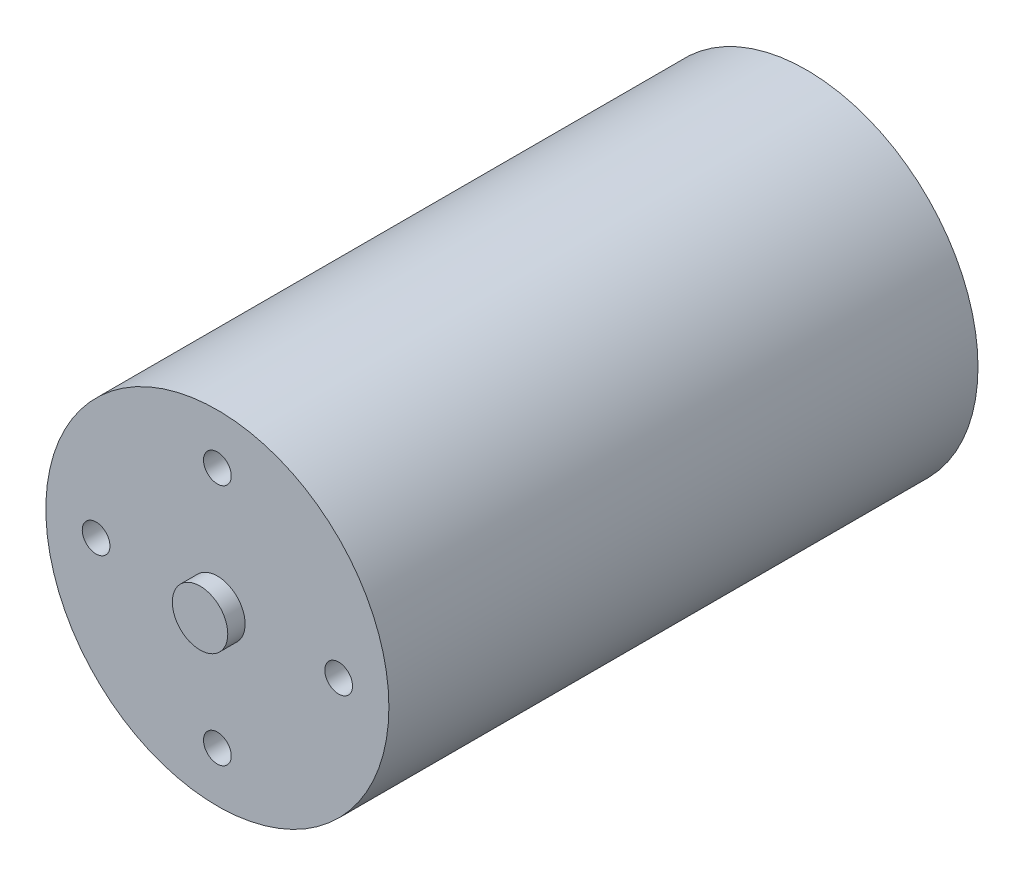
ISO-10303-21;
HEADER;
FILE_DESCRIPTION(('STEP AP214'),'2;1');
FILE_NAME('part.step','',(''),(''),'','','');
FILE_SCHEMA(('AUTOMOTIVE_DESIGN { 1 0 10303 214 1 1 1 1 }'));
ENDSEC;
DATA;
#1=APPLICATION_CONTEXT('core data for automotive mechanical design processes');
#2=APPLICATION_PROTOCOL_DEFINITION('international standard','automotive_design',2000,#1);
#3=PRODUCT_CONTEXT('',#1,'mechanical');
#4=PRODUCT('Part','Part','',(#3));
#5=PRODUCT_RELATED_PRODUCT_CATEGORY('part','',(#4));
#6=PRODUCT_DEFINITION_FORMATION('','',#4);
#7=PRODUCT_DEFINITION_CONTEXT('part definition',#1,'design');
#8=PRODUCT_DEFINITION('design','',#6,#7);
#9=PRODUCT_DEFINITION_SHAPE('','',#8);
#10=(LENGTH_UNIT() NAMED_UNIT(*) SI_UNIT(.MILLI.,.METRE.));
#11=(NAMED_UNIT(*) PLANE_ANGLE_UNIT() SI_UNIT($,.RADIAN.));
#12=(NAMED_UNIT(*) SI_UNIT($,.STERADIAN.) SOLID_ANGLE_UNIT());
#13=UNCERTAINTY_MEASURE_WITH_UNIT(LENGTH_MEASURE(1.E-05),#10,'distance_accuracy_value','');
#14=(GEOMETRIC_REPRESENTATION_CONTEXT(3) GLOBAL_UNCERTAINTY_ASSIGNED_CONTEXT((#13)) GLOBAL_UNIT_ASSIGNED_CONTEXT((#10,
#11,#12)) REPRESENTATION_CONTEXT('',''));
#15=CARTESIAN_POINT('',(0.,0.,0.));
#16=DIRECTION('',(0.,0.,1.));
#17=DIRECTION('',(1.,0.,0.));
#18=AXIS2_PLACEMENT_3D('',#15,#16,#17);
#19=CARTESIAN_POINT('',(0.,0.,-42.5));
#20=DIRECTION('',(0.,0.,1.));
#21=DIRECTION('',(1.,0.,0.));
#22=AXIS2_PLACEMENT_3D('',#19,#20,#21);
#23=CYLINDRICAL_SURFACE('',#22,24.75);
#24=CARTESIAN_POINT('',(0.,0.,-42.5));
#25=DIRECTION('',(0.,0.,1.));
#26=DIRECTION('',(1.,0.,0.));
#27=AXIS2_PLACEMENT_3D('',#24,#25,#26);
#28=CIRCLE('',#27,24.75);
#29=CARTESIAN_POINT('',(24.75,0.,-42.5));
#30=VERTEX_POINT('',#29);
#31=EDGE_CURVE('E49',#30,#30,#28,.T.);
#32=ORIENTED_EDGE('',*,*,#31,.T.);
#33=EDGE_LOOP('',(#32));
#34=FACE_BOUND('',#33,.T.);
#35=CARTESIAN_POINT('',(0.,0.,42.5));
#36=DIRECTION('',(0.,0.,1.));
#37=DIRECTION('',(1.,0.,0.));
#38=AXIS2_PLACEMENT_3D('',#35,#36,#37);
#39=CIRCLE('',#38,24.75);
#40=CARTESIAN_POINT('',(24.75,0.,42.5));
#41=VERTEX_POINT('',#40);
#42=EDGE_CURVE('E55',#41,#41,#39,.T.);
#43=ORIENTED_EDGE('',*,*,#42,.F.);
#44=EDGE_LOOP('',(#43));
#45=FACE_BOUND('',#44,.T.);
#46=ADVANCED_FACE('F37',(#34,#45),#23,.T.);
#47=CARTESIAN_POINT('',(0.,0.,-42.5));
#48=DIRECTION('',(0.,0.,1.));
#49=DIRECTION('',(1.,0.,0.));
#50=AXIS2_PLACEMENT_3D('',#47,#48,#49);
#51=PLANE('',#50);
#52=CARTESIAN_POINT('',(0.,0.,-42.5));
#53=DIRECTION('',(0.,0.,1.));
#54=DIRECTION('',(1.,0.,0.));
#55=AXIS2_PLACEMENT_3D('',#52,#53,#54);
#56=CIRCLE('',#55,10.5);
#57=CARTESIAN_POINT('',(10.5,0.,-42.5));
#58=VERTEX_POINT('',#57);
#59=EDGE_CURVE('E10',#58,#58,#56,.F.);
#60=ORIENTED_EDGE('',*,*,#59,.F.);
#61=EDGE_LOOP('',(#60));
#62=FACE_BOUND('',#61,.T.);
#63=CARTESIAN_POINT('',(0.,17.5,-42.5));
#64=DIRECTION('',(0.,0.,-1.));
#65=DIRECTION('',(0.,-1.,0.));
#66=AXIS2_PLACEMENT_3D('',#63,#64,#65);
#67=CIRCLE('',#66,2.);
#68=CARTESIAN_POINT('',(0.,15.5,-42.5));
#69=VERTEX_POINT('',#68);
#70=EDGE_CURVE('E128',#69,#69,#67,.T.);
#71=ORIENTED_EDGE('',*,*,#70,.F.);
#72=EDGE_LOOP('',(#71));
#73=FACE_BOUND('',#72,.T.);
#74=CARTESIAN_POINT('',(-17.5,0.,-42.5));
#75=DIRECTION('',(0.,0.,-1.));
#76=DIRECTION('',(1.,0.,0.));
#77=AXIS2_PLACEMENT_3D('',#74,#75,#76);
#78=CIRCLE('',#77,2.);
#79=CARTESIAN_POINT('',(-15.5,0.,-42.5));
#80=VERTEX_POINT('',#79);
#81=EDGE_CURVE('E120',#80,#80,#78,.T.);
#82=ORIENTED_EDGE('',*,*,#81,.F.);
#83=EDGE_LOOP('',(#82));
#84=FACE_BOUND('',#83,.T.);
#85=CARTESIAN_POINT('',(1.83302770289265E-13,-17.5,-42.5));
#86=DIRECTION('',(0.,0.,-1.));
#87=DIRECTION('',(0.,1.,0.));
#88=AXIS2_PLACEMENT_3D('',#85,#86,#87);
#89=CIRCLE('',#88,2.);
#90=CARTESIAN_POINT('',(1.62353882256206E-13,-15.5,-42.5));
#91=VERTEX_POINT('',#90);
#92=EDGE_CURVE('E111',#91,#91,#89,.T.);
#93=ORIENTED_EDGE('',*,*,#92,.F.);
#94=EDGE_LOOP('',(#93));
#95=FACE_BOUND('',#94,.T.);
#96=CARTESIAN_POINT('',(17.5,0.,-42.5));
#97=DIRECTION('',(0.,0.,-1.));
#98=DIRECTION('',(-1.,0.,0.));
#99=AXIS2_PLACEMENT_3D('',#96,#97,#98);
#100=CIRCLE('',#99,2.);
#101=CARTESIAN_POINT('',(15.5,0.,-42.5));
#102=VERTEX_POINT('',#101);
#103=EDGE_CURVE('E103',#102,#102,#100,.T.);
#104=ORIENTED_EDGE('',*,*,#103,.F.);
#105=EDGE_LOOP('',(#104));
#106=FACE_BOUND('',#105,.T.);
#107=ORIENTED_EDGE('',*,*,#31,.F.);
#108=EDGE_LOOP('',(#107));
#109=FACE_BOUND('',#108,.T.);
#110=ADVANCED_FACE('F154',(#62,#73,#84,#95,#106,#109),#51,.F.);
#111=CARTESIAN_POINT('',(0.,0.,42.5));
#112=DIRECTION('',(0.,0.,1.));
#113=DIRECTION('',(1.,0.,0.));
#114=AXIS2_PLACEMENT_3D('',#111,#112,#113);
#115=PLANE('',#114);
#116=CARTESIAN_POINT('',(-17.5,0.,42.5));
#117=DIRECTION('',(0.,0.,1.));
#118=DIRECTION('',(0.,1.,0.));
#119=AXIS2_PLACEMENT_3D('',#116,#117,#118);
#120=CIRCLE('',#119,2.);
#121=CARTESIAN_POINT('',(-17.5,1.99999999999994,42.5));
#122=VERTEX_POINT('',#121);
#123=EDGE_CURVE('E96',#122,#122,#120,.T.);
#124=ORIENTED_EDGE('',*,*,#123,.F.);
#125=EDGE_LOOP('',(#124));
#126=FACE_BOUND('',#125,.T.);
#127=CARTESIAN_POINT('',(0.,-17.5,42.5));
#128=DIRECTION('',(0.,0.,1.));
#129=DIRECTION('',(-1.,0.,0.));
#130=AXIS2_PLACEMENT_3D('',#127,#128,#129);
#131=CIRCLE('',#130,2.);
#132=CARTESIAN_POINT('',(-2.,-17.5,42.5));
#133=VERTEX_POINT('',#132);
#134=EDGE_CURVE('E88',#133,#133,#131,.T.);
#135=ORIENTED_EDGE('',*,*,#134,.F.);
#136=EDGE_LOOP('',(#135));
#137=FACE_BOUND('',#136,.T.);
#138=CARTESIAN_POINT('',(17.5,1.83302770289265E-13,42.5));
#139=DIRECTION('',(0.,0.,1.));
#140=DIRECTION('',(0.,-1.,0.));
#141=AXIS2_PLACEMENT_3D('',#138,#139,#140);
#142=CIRCLE('',#141,2.);
#143=CARTESIAN_POINT('',(17.5,-1.99999999999982,42.5));
#144=VERTEX_POINT('',#143);
#145=EDGE_CURVE('E79',#144,#144,#142,.T.);
#146=ORIENTED_EDGE('',*,*,#145,.F.);
#147=EDGE_LOOP('',(#146));
#148=FACE_BOUND('',#147,.T.);
#149=CARTESIAN_POINT('',(0.,17.5,42.5));
#150=DIRECTION('',(0.,0.,1.));
#151=DIRECTION('',(1.,0.,0.));
#152=AXIS2_PLACEMENT_3D('',#149,#150,#151);
#153=CIRCLE('',#152,2.);
#154=CARTESIAN_POINT('',(2.,17.5,42.5));
#155=VERTEX_POINT('',#154);
#156=EDGE_CURVE('E71',#155,#155,#153,.T.);
#157=ORIENTED_EDGE('',*,*,#156,.F.);
#158=EDGE_LOOP('',(#157));
#159=FACE_BOUND('',#158,.T.);
#160=CARTESIAN_POINT('',(0.,0.,42.5));
#161=DIRECTION('',(0.,0.,1.));
#162=DIRECTION('',(1.,0.,0.));
#163=AXIS2_PLACEMENT_3D('',#160,#161,#162);
#164=CIRCLE('',#163,4.);
#165=CARTESIAN_POINT('',(4.,0.,42.5));
#166=VERTEX_POINT('',#165);
#167=EDGE_CURVE('E44',#166,#166,#164,.T.);
#168=ORIENTED_EDGE('',*,*,#167,.F.);
#169=EDGE_LOOP('',(#168));
#170=FACE_BOUND('',#169,.T.);
#171=ORIENTED_EDGE('',*,*,#42,.T.);
#172=EDGE_LOOP('',(#171));
#173=FACE_BOUND('',#172,.T.);
#174=ADVANCED_FACE('F159',(#126,#137,#148,#159,#170,#173),#115,.T.);
#175=CARTESIAN_POINT('',(0.,0.,45.));
#176=DIRECTION('',(0.,0.,-1.));
#177=DIRECTION('',(-1.,0.,0.));
#178=AXIS2_PLACEMENT_3D('',#175,#176,#177);
#179=CYLINDRICAL_SURFACE('',#178,4.);
#180=CARTESIAN_POINT('',(0.,0.,45.));
#181=DIRECTION('',(0.,0.,1.));
#182=DIRECTION('',(1.,0.,0.));
#183=AXIS2_PLACEMENT_3D('',#180,#181,#182);
#184=CIRCLE('',#183,4.);
#185=CARTESIAN_POINT('',(4.,0.,45.));
#186=VERTEX_POINT('',#185);
#187=EDGE_CURVE('E58',#186,#186,#184,.T.);
#188=ORIENTED_EDGE('',*,*,#187,.F.);
#189=EDGE_LOOP('',(#188));
#190=FACE_BOUND('',#189,.T.);
#191=ORIENTED_EDGE('',*,*,#167,.T.);
#192=EDGE_LOOP('',(#191));
#193=FACE_BOUND('',#192,.T.);
#194=ADVANCED_FACE('F168',(#190,#193),#179,.T.);
#195=CARTESIAN_POINT('',(0.,0.,45.));
#196=DIRECTION('',(0.,0.,1.));
#197=DIRECTION('',(1.,0.,0.));
#198=AXIS2_PLACEMENT_3D('',#195,#196,#197);
#199=PLANE('',#198);
#200=ORIENTED_EDGE('',*,*,#187,.T.);
#201=EDGE_LOOP('',(#200));
#202=FACE_BOUND('',#201,.T.);
#203=ADVANCED_FACE('F174',(#202),#199,.T.);
#204=CARTESIAN_POINT('',(0.,17.5,37.5));
#205=DIRECTION('',(0.,0.,1.));
#206=DIRECTION('',(1.,0.,0.));
#207=AXIS2_PLACEMENT_3D('',#204,#205,#206);
#208=CYLINDRICAL_SURFACE('',#207,2.);
#209=CARTESIAN_POINT('',(0.,17.5,37.5));
#210=DIRECTION('',(0.,0.,1.));
#211=DIRECTION('',(1.,0.,0.));
#212=AXIS2_PLACEMENT_3D('',#209,#210,#211);
#213=CIRCLE('',#212,2.);
#214=CARTESIAN_POINT('',(2.,17.5,37.5));
#215=VERTEX_POINT('',#214);
#216=EDGE_CURVE('E66',#215,#215,#213,.T.);
#217=ORIENTED_EDGE('',*,*,#216,.F.);
#218=EDGE_LOOP('',(#217));
#219=FACE_BOUND('',#218,.T.);
#220=ORIENTED_EDGE('',*,*,#156,.T.);
#221=EDGE_LOOP('',(#220));
#222=FACE_BOUND('',#221,.T.);
#223=ADVANCED_FACE('F178',(#219,#222),#208,.F.);
#224=CARTESIAN_POINT('',(0.,17.5,37.5));
#225=DIRECTION('',(0.,0.,1.));
#226=DIRECTION('',(1.,0.,0.));
#227=AXIS2_PLACEMENT_3D('',#224,#225,#226);
#228=PLANE('',#227);
#229=ORIENTED_EDGE('',*,*,#216,.T.);
#230=EDGE_LOOP('',(#229));
#231=FACE_BOUND('',#230,.T.);
#232=ADVANCED_FACE('F181',(#231),#228,.T.);
#233=CARTESIAN_POINT('',(17.5,1.83302770289265E-13,37.5));
#234=DIRECTION('',(0.,0.,1.));
#235=DIRECTION('',(1.,0.,0.));
#236=AXIS2_PLACEMENT_3D('',#233,#234,#235);
#237=CYLINDRICAL_SURFACE('',#236,2.);
#238=CARTESIAN_POINT('',(17.5,1.83302770289265E-13,37.5));
#239=DIRECTION('',(0.,0.,1.));
#240=DIRECTION('',(0.,-1.,0.));
#241=AXIS2_PLACEMENT_3D('',#238,#239,#240);
#242=CIRCLE('',#241,2.);
#243=CARTESIAN_POINT('',(17.5,-1.99999999999982,37.5));
#244=VERTEX_POINT('',#243);
#245=EDGE_CURVE('E83',#244,#244,#242,.T.);
#246=ORIENTED_EDGE('',*,*,#245,.F.);
#247=EDGE_LOOP('',(#246));
#248=FACE_BOUND('',#247,.T.);
#249=ORIENTED_EDGE('',*,*,#145,.T.);
#250=EDGE_LOOP('',(#249));
#251=FACE_BOUND('',#250,.T.);
#252=ADVANCED_FACE('F185',(#248,#251),#237,.F.);
#253=CARTESIAN_POINT('',(17.5,1.83302770289265E-13,37.5));
#254=DIRECTION('',(0.,0.,1.));
#255=DIRECTION('',(0.,-1.,0.));
#256=AXIS2_PLACEMENT_3D('',#253,#254,#255);
#257=PLANE('',#256);
#258=ORIENTED_EDGE('',*,*,#245,.T.);
#259=EDGE_LOOP('',(#258));
#260=FACE_BOUND('',#259,.T.);
#261=ADVANCED_FACE('F188',(#260),#257,.T.);
#262=CARTESIAN_POINT('',(0.,-17.5,37.5));
#263=DIRECTION('',(0.,0.,1.));
#264=DIRECTION('',(1.,0.,0.));
#265=AXIS2_PLACEMENT_3D('',#262,#263,#264);
#266=CYLINDRICAL_SURFACE('',#265,2.);
#267=CARTESIAN_POINT('',(0.,-17.5,37.5));
#268=DIRECTION('',(0.,0.,1.));
#269=DIRECTION('',(-1.,0.,0.));
#270=AXIS2_PLACEMENT_3D('',#267,#268,#269);
#271=CIRCLE('',#270,2.);
#272=CARTESIAN_POINT('',(-2.,-17.5,37.5));
#273=VERTEX_POINT('',#272);
#274=EDGE_CURVE('E92',#273,#273,#271,.T.);
#275=ORIENTED_EDGE('',*,*,#274,.F.);
#276=EDGE_LOOP('',(#275));
#277=FACE_BOUND('',#276,.T.);
#278=ORIENTED_EDGE('',*,*,#134,.T.);
#279=EDGE_LOOP('',(#278));
#280=FACE_BOUND('',#279,.T.);
#281=ADVANCED_FACE('F192',(#277,#280),#266,.F.);
#282=CARTESIAN_POINT('',(0.,-17.5,37.5));
#283=DIRECTION('',(0.,0.,1.));
#284=DIRECTION('',(-1.,0.,0.));
#285=AXIS2_PLACEMENT_3D('',#282,#283,#284);
#286=PLANE('',#285);
#287=ORIENTED_EDGE('',*,*,#274,.T.);
#288=EDGE_LOOP('',(#287));
#289=FACE_BOUND('',#288,.T.);
#290=ADVANCED_FACE('F196',(#289),#286,.T.);
#291=CARTESIAN_POINT('',(-17.5,0.,37.5));
#292=DIRECTION('',(0.,0.,1.));
#293=DIRECTION('',(1.,0.,0.));
#294=AXIS2_PLACEMENT_3D('',#291,#292,#293);
#295=CYLINDRICAL_SURFACE('',#294,2.);
#296=CARTESIAN_POINT('',(-17.5,0.,37.5));
#297=DIRECTION('',(0.,0.,1.));
#298=DIRECTION('',(0.,1.,0.));
#299=AXIS2_PLACEMENT_3D('',#296,#297,#298);
#300=CIRCLE('',#299,2.);
#301=CARTESIAN_POINT('',(-17.5,1.99999999999994,37.5));
#302=VERTEX_POINT('',#301);
#303=EDGE_CURVE('E77',#302,#302,#300,.T.);
#304=ORIENTED_EDGE('',*,*,#303,.F.);
#305=EDGE_LOOP('',(#304));
#306=FACE_BOUND('',#305,.T.);
#307=ORIENTED_EDGE('',*,*,#123,.T.);
#308=EDGE_LOOP('',(#307));
#309=FACE_BOUND('',#308,.T.);
#310=ADVANCED_FACE('F200',(#306,#309),#295,.F.);
#311=CARTESIAN_POINT('',(-17.5,0.,37.5));
#312=DIRECTION('',(0.,0.,1.));
#313=DIRECTION('',(0.,1.,0.));
#314=AXIS2_PLACEMENT_3D('',#311,#312,#313);
#315=PLANE('',#314);
#316=ORIENTED_EDGE('',*,*,#303,.T.);
#317=EDGE_LOOP('',(#316));
#318=FACE_BOUND('',#317,.T.);
#319=ADVANCED_FACE('F204',(#318),#315,.T.);
#320=CARTESIAN_POINT('',(17.5,0.,-32.5));
#321=DIRECTION('',(0.,0.,-1.));
#322=DIRECTION('',(-1.,0.,0.));
#323=AXIS2_PLACEMENT_3D('',#320,#321,#322);
#324=CYLINDRICAL_SURFACE('',#323,2.);
#325=CARTESIAN_POINT('',(17.5,0.,-32.5));
#326=DIRECTION('',(0.,0.,-1.));
#327=DIRECTION('',(-1.,0.,0.));
#328=AXIS2_PLACEMENT_3D('',#325,#326,#327);
#329=CIRCLE('',#328,2.);
#330=CARTESIAN_POINT('',(15.5,0.,-32.5));
#331=VERTEX_POINT('',#330);
#332=EDGE_CURVE('E84',#331,#331,#329,.T.);
#333=ORIENTED_EDGE('',*,*,#332,.F.);
#334=EDGE_LOOP('',(#333));
#335=FACE_BOUND('',#334,.T.);
#336=ORIENTED_EDGE('',*,*,#103,.T.);
#337=EDGE_LOOP('',(#336));
#338=FACE_BOUND('',#337,.T.);
#339=ADVANCED_FACE('F208',(#335,#338),#324,.F.);
#340=CARTESIAN_POINT('',(17.5,0.,-32.5));
#341=DIRECTION('',(0.,0.,-1.));
#342=DIRECTION('',(-1.,0.,0.));
#343=AXIS2_PLACEMENT_3D('',#340,#341,#342);
#344=PLANE('',#343);
#345=ORIENTED_EDGE('',*,*,#332,.T.);
#346=EDGE_LOOP('',(#345));
#347=FACE_BOUND('',#346,.T.);
#348=ADVANCED_FACE('F212',(#347),#344,.T.);
#349=CARTESIAN_POINT('',(1.83302770289265E-13,-17.5,-32.5));
#350=DIRECTION('',(0.,0.,-1.));
#351=DIRECTION('',(-1.,0.,0.));
#352=AXIS2_PLACEMENT_3D('',#349,#350,#351);
#353=CYLINDRICAL_SURFACE('',#352,2.);
#354=CARTESIAN_POINT('',(1.83302770289265E-13,-17.5,-32.5));
#355=DIRECTION('',(0.,0.,-1.));
#356=DIRECTION('',(0.,1.,0.));
#357=AXIS2_PLACEMENT_3D('',#354,#355,#356);
#358=CIRCLE('',#357,2.);
#359=CARTESIAN_POINT('',(1.62353882256206E-13,-15.5,-32.5));
#360=VERTEX_POINT('',#359);
#361=EDGE_CURVE('E115',#360,#360,#358,.T.);
#362=ORIENTED_EDGE('',*,*,#361,.F.);
#363=EDGE_LOOP('',(#362));
#364=FACE_BOUND('',#363,.T.);
#365=ORIENTED_EDGE('',*,*,#92,.T.);
#366=EDGE_LOOP('',(#365));
#367=FACE_BOUND('',#366,.T.);
#368=ADVANCED_FACE('F216',(#364,#367),#353,.F.);
#369=CARTESIAN_POINT('',(1.83302770289265E-13,-17.5,-32.5));
#370=DIRECTION('',(0.,0.,-1.));
#371=DIRECTION('',(0.,1.,0.));
#372=AXIS2_PLACEMENT_3D('',#369,#370,#371);
#373=PLANE('',#372);
#374=ORIENTED_EDGE('',*,*,#361,.T.);
#375=EDGE_LOOP('',(#374));
#376=FACE_BOUND('',#375,.T.);
#377=ADVANCED_FACE('F220',(#376),#373,.T.);
#378=CARTESIAN_POINT('',(-17.5,0.,-32.5));
#379=DIRECTION('',(0.,0.,-1.));
#380=DIRECTION('',(-1.,0.,0.));
#381=AXIS2_PLACEMENT_3D('',#378,#379,#380);
#382=CYLINDRICAL_SURFACE('',#381,2.);
#383=CARTESIAN_POINT('',(-17.5,0.,-32.5));
#384=DIRECTION('',(0.,0.,-1.));
#385=DIRECTION('',(1.,0.,0.));
#386=AXIS2_PLACEMENT_3D('',#383,#384,#385);
#387=CIRCLE('',#386,2.);
#388=CARTESIAN_POINT('',(-15.5,0.,-32.5));
#389=VERTEX_POINT('',#388);
#390=EDGE_CURVE('E124',#389,#389,#387,.T.);
#391=ORIENTED_EDGE('',*,*,#390,.F.);
#392=EDGE_LOOP('',(#391));
#393=FACE_BOUND('',#392,.T.);
#394=ORIENTED_EDGE('',*,*,#81,.T.);
#395=EDGE_LOOP('',(#394));
#396=FACE_BOUND('',#395,.T.);
#397=ADVANCED_FACE('F224',(#393,#396),#382,.F.);
#398=CARTESIAN_POINT('',(-17.5,0.,-32.5));
#399=DIRECTION('',(0.,0.,-1.));
#400=DIRECTION('',(1.,0.,0.));
#401=AXIS2_PLACEMENT_3D('',#398,#399,#400);
#402=PLANE('',#401);
#403=ORIENTED_EDGE('',*,*,#390,.T.);
#404=EDGE_LOOP('',(#403));
#405=FACE_BOUND('',#404,.T.);
#406=ADVANCED_FACE('F228',(#405),#402,.T.);
#407=CARTESIAN_POINT('',(0.,17.5,-32.5));
#408=DIRECTION('',(0.,0.,-1.));
#409=DIRECTION('',(-1.,0.,0.));
#410=AXIS2_PLACEMENT_3D('',#407,#408,#409);
#411=CYLINDRICAL_SURFACE('',#410,2.);
#412=CARTESIAN_POINT('',(0.,17.5,-32.5));
#413=DIRECTION('',(0.,0.,-1.));
#414=DIRECTION('',(0.,-1.,0.));
#415=AXIS2_PLACEMENT_3D('',#412,#413,#414);
#416=CIRCLE('',#415,2.);
#417=CARTESIAN_POINT('',(0.,15.5,-32.5));
#418=VERTEX_POINT('',#417);
#419=EDGE_CURVE('E107',#418,#418,#416,.T.);
#420=ORIENTED_EDGE('',*,*,#419,.F.);
#421=EDGE_LOOP('',(#420));
#422=FACE_BOUND('',#421,.T.);
#423=ORIENTED_EDGE('',*,*,#70,.T.);
#424=EDGE_LOOP('',(#423));
#425=FACE_BOUND('',#424,.T.);
#426=ADVANCED_FACE('F150',(#422,#425),#411,.F.);
#427=CARTESIAN_POINT('',(0.,17.5,-32.5));
#428=DIRECTION('',(0.,0.,-1.));
#429=DIRECTION('',(0.,-1.,0.));
#430=AXIS2_PLACEMENT_3D('',#427,#428,#429);
#431=PLANE('',#430);
#432=ORIENTED_EDGE('',*,*,#419,.T.);
#433=EDGE_LOOP('',(#432));
#434=FACE_BOUND('',#433,.T.);
#435=ADVANCED_FACE('F143',(#434),#431,.T.);
#436=CARTESIAN_POINT('',(0.,0.,-47.5));
#437=DIRECTION('',(0.,0.,1.));
#438=DIRECTION('',(1.,0.,0.));
#439=AXIS2_PLACEMENT_3D('',#436,#437,#438);
#440=CYLINDRICAL_SURFACE('',#439,10.5);
#441=CARTESIAN_POINT('',(0.,0.,-47.5));
#442=DIRECTION('',(0.,0.,-1.));
#443=DIRECTION('',(-1.,0.,0.));
#444=AXIS2_PLACEMENT_3D('',#441,#442,#443);
#445=CIRCLE('',#444,10.5);
#446=CARTESIAN_POINT('',(-10.5,0.,-47.5));
#447=VERTEX_POINT('',#446);
#448=EDGE_CURVE('E116',#447,#447,#445,.T.);
#449=ORIENTED_EDGE('',*,*,#448,.F.);
#450=EDGE_LOOP('',(#449));
#451=FACE_BOUND('',#450,.T.);
#452=ORIENTED_EDGE('',*,*,#59,.T.);
#453=EDGE_LOOP('',(#452));
#454=FACE_BOUND('',#453,.T.);
#455=ADVANCED_FACE('F141',(#451,#454),#440,.T.);
#456=CARTESIAN_POINT('',(0.,0.,-47.5));
#457=DIRECTION('',(0.,0.,-1.));
#458=DIRECTION('',(-1.,0.,0.));
#459=AXIS2_PLACEMENT_3D('',#456,#457,#458);
#460=PLANE('',#459);
#461=ORIENTED_EDGE('',*,*,#448,.T.);
#462=EDGE_LOOP('',(#461));
#463=FACE_BOUND('',#462,.T.);
#464=ADVANCED_FACE('F139',(#463),#460,.T.);
#465=CLOSED_SHELL('',(#46,#110,#174,#194,#203,#223,#232,#252,#261,#281,#290,#310,#319,#339,#348,
#368,#377,#397,#406,#426,#435,#455,#464));
#466=MANIFOLD_SOLID_BREP('B2',#465);
#467=ADVANCED_BREP_SHAPE_REPRESENTATION('',(#18,#466),#14);
#468=SHAPE_DEFINITION_REPRESENTATION(#9,#467);
ENDSEC;
END-ISO-10303-21;
